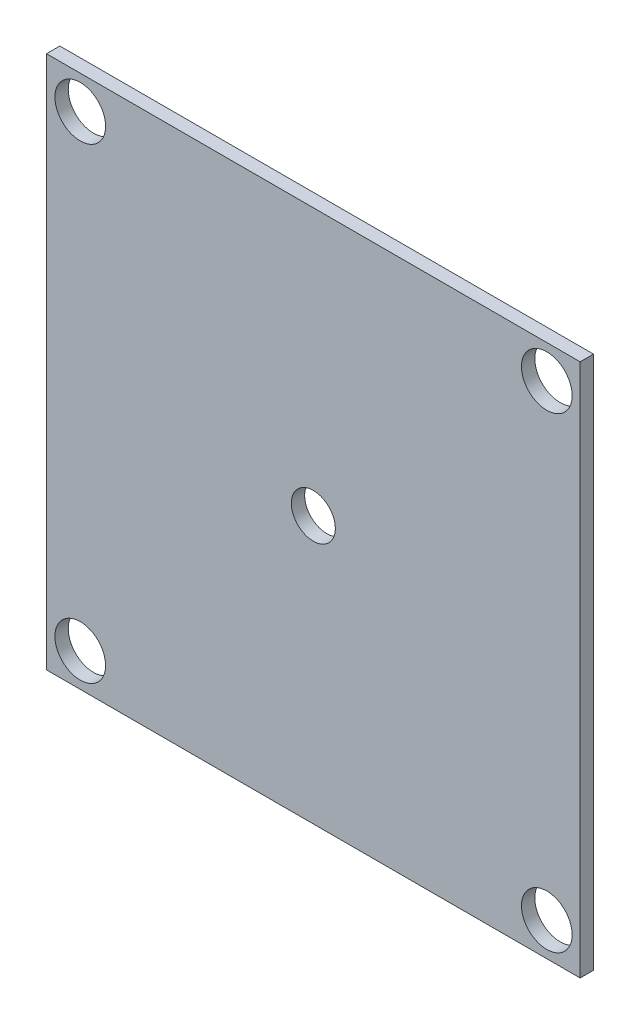
ISO-10303-21;
HEADER;
FILE_DESCRIPTION(('STEP AP214'),'2;1');
FILE_NAME('part.step','',(''),(''),'','','');
FILE_SCHEMA(('AUTOMOTIVE_DESIGN { 1 0 10303 214 1 1 1 1 }'));
ENDSEC;
DATA;
#1=APPLICATION_CONTEXT('core data for automotive mechanical design processes');
#2=APPLICATION_PROTOCOL_DEFINITION('international standard','automotive_design',2000,#1);
#3=PRODUCT_CONTEXT('',#1,'mechanical');
#4=PRODUCT('Part','Part','',(#3));
#5=PRODUCT_RELATED_PRODUCT_CATEGORY('part','',(#4));
#6=PRODUCT_DEFINITION_FORMATION('','',#4);
#7=PRODUCT_DEFINITION_CONTEXT('part definition',#1,'design');
#8=PRODUCT_DEFINITION('design','',#6,#7);
#9=PRODUCT_DEFINITION_SHAPE('','',#8);
#10=(LENGTH_UNIT() NAMED_UNIT(*) SI_UNIT(.MILLI.,.METRE.));
#11=(NAMED_UNIT(*) PLANE_ANGLE_UNIT() SI_UNIT($,.RADIAN.));
#12=(NAMED_UNIT(*) SI_UNIT($,.STERADIAN.) SOLID_ANGLE_UNIT());
#13=UNCERTAINTY_MEASURE_WITH_UNIT(LENGTH_MEASURE(1.E-05),#10,'distance_accuracy_value','');
#14=(GEOMETRIC_REPRESENTATION_CONTEXT(3) GLOBAL_UNCERTAINTY_ASSIGNED_CONTEXT((#13)) GLOBAL_UNIT_ASSIGNED_CONTEXT((#10,
#11,#12)) REPRESENTATION_CONTEXT('',''));
#15=CARTESIAN_POINT('',(0.,0.,0.));
#16=DIRECTION('',(0.,0.,1.));
#17=DIRECTION('',(1.,0.,0.));
#18=AXIS2_PLACEMENT_3D('',#15,#16,#17);
#19=CARTESIAN_POINT('',(50.8,-50.8,2.54));
#20=DIRECTION('',(-1.,0.,0.));
#21=DIRECTION('',(0.,0.,1.));
#22=AXIS2_PLACEMENT_3D('',#19,#20,#21);
#23=PLANE('',#22);
#24=DIRECTION('',(0.,1.,0.));
#25=VECTOR('',#24,1.);
#26=CARTESIAN_POINT('',(50.8,-50.8,0.));
#27=LINE('',#26,#25);
#28=CARTESIAN_POINT('',(50.8,-50.8,0.));
#29=VERTEX_POINT('',#28);
#30=CARTESIAN_POINT('',(50.8,50.8,0.));
#31=VERTEX_POINT('',#30);
#32=EDGE_CURVE('E104',#29,#31,#27,.T.);
#33=ORIENTED_EDGE('',*,*,#32,.T.);
#34=DIRECTION('',(0.,0.,-1.));
#35=VECTOR('',#34,1.);
#36=CARTESIAN_POINT('',(50.8,50.8,2.54));
#37=LINE('',#36,#35);
#38=CARTESIAN_POINT('',(50.8,50.8,2.54));
#39=VERTEX_POINT('',#38);
#40=EDGE_CURVE('E11',#39,#31,#37,.T.);
#41=ORIENTED_EDGE('',*,*,#40,.F.);
#42=DIRECTION('',(0.,1.,0.));
#43=VECTOR('',#42,1.);
#44=CARTESIAN_POINT('',(50.8,-50.8,2.54));
#45=LINE('',#44,#43);
#46=CARTESIAN_POINT('',(50.8,-50.8,2.54));
#47=VERTEX_POINT('',#46);
#48=EDGE_CURVE('E91',#47,#39,#45,.T.);
#49=ORIENTED_EDGE('',*,*,#48,.F.);
#50=DIRECTION('',(0.,0.,-1.));
#51=VECTOR('',#50,1.);
#52=CARTESIAN_POINT('',(50.8,-50.8,2.54));
#53=LINE('',#52,#51);
#54=EDGE_CURVE('E100',#47,#29,#53,.T.);
#55=ORIENTED_EDGE('',*,*,#54,.T.);
#56=EDGE_LOOP('',(#33,#41,#49,#55));
#57=FACE_BOUND('',#56,.T.);
#58=ADVANCED_FACE('F39',(#57),#23,.F.);
#59=CARTESIAN_POINT('',(-50.8,50.8,2.54));
#60=DIRECTION('',(0.,-1.,0.));
#61=DIRECTION('',(0.,0.,-1.));
#62=AXIS2_PLACEMENT_3D('',#59,#60,#61);
#63=PLANE('',#62);
#64=DIRECTION('',(-1.,0.,0.));
#65=VECTOR('',#64,1.);
#66=CARTESIAN_POINT('',(-50.8,50.8,0.));
#67=LINE('',#66,#65);
#68=CARTESIAN_POINT('',(-50.8,50.8,0.));
#69=VERTEX_POINT('',#68);
#70=EDGE_CURVE('E95',#31,#69,#67,.T.);
#71=ORIENTED_EDGE('',*,*,#70,.T.);
#72=DIRECTION('',(0.,0.,-1.));
#73=VECTOR('',#72,1.);
#74=CARTESIAN_POINT('',(-50.8,50.8,2.54));
#75=LINE('',#74,#73);
#76=CARTESIAN_POINT('',(-50.8,50.8,2.54));
#77=VERTEX_POINT('',#76);
#78=EDGE_CURVE('E48',#77,#69,#75,.T.);
#79=ORIENTED_EDGE('',*,*,#78,.F.);
#80=DIRECTION('',(-1.,0.,0.));
#81=VECTOR('',#80,1.);
#82=CARTESIAN_POINT('',(-50.8,50.8,2.54));
#83=LINE('',#82,#81);
#84=EDGE_CURVE('E86',#39,#77,#83,.T.);
#85=ORIENTED_EDGE('',*,*,#84,.F.);
#86=ORIENTED_EDGE('',*,*,#40,.T.);
#87=EDGE_LOOP('',(#71,#79,#85,#86));
#88=FACE_BOUND('',#87,.T.);
#89=ADVANCED_FACE('F94',(#88),#63,.F.);
#90=CARTESIAN_POINT('',(-50.8,-50.8,2.54));
#91=DIRECTION('',(1.,0.,0.));
#92=DIRECTION('',(0.,0.,-1.));
#93=AXIS2_PLACEMENT_3D('',#90,#91,#92);
#94=PLANE('',#93);
#95=DIRECTION('',(0.,-1.,0.));
#96=VECTOR('',#95,1.);
#97=CARTESIAN_POINT('',(-50.8,-50.8,0.));
#98=LINE('',#97,#96);
#99=CARTESIAN_POINT('',(-50.8,-50.8,0.));
#100=VERTEX_POINT('',#99);
#101=EDGE_CURVE('E73',#69,#100,#98,.T.);
#102=ORIENTED_EDGE('',*,*,#101,.T.);
#103=DIRECTION('',(0.,0.,-1.));
#104=VECTOR('',#103,1.);
#105=CARTESIAN_POINT('',(-50.8,-50.8,2.54));
#106=LINE('',#105,#104);
#107=CARTESIAN_POINT('',(-50.8,-50.8,2.54));
#108=VERTEX_POINT('',#107);
#109=EDGE_CURVE('E96',#108,#100,#106,.T.);
#110=ORIENTED_EDGE('',*,*,#109,.F.);
#111=DIRECTION('',(0.,-1.,0.));
#112=VECTOR('',#111,1.);
#113=CARTESIAN_POINT('',(-50.8,-50.8,2.54));
#114=LINE('',#113,#112);
#115=EDGE_CURVE('E89',#77,#108,#114,.T.);
#116=ORIENTED_EDGE('',*,*,#115,.F.);
#117=ORIENTED_EDGE('',*,*,#78,.T.);
#118=EDGE_LOOP('',(#102,#110,#116,#117));
#119=FACE_BOUND('',#118,.T.);
#120=ADVANCED_FACE('F98',(#119),#94,.F.);
#121=CARTESIAN_POINT('',(-50.8,-50.8,2.54));
#122=DIRECTION('',(0.,1.,0.));
#123=DIRECTION('',(0.,0.,1.));
#124=AXIS2_PLACEMENT_3D('',#121,#122,#123);
#125=PLANE('',#124);
#126=DIRECTION('',(1.,0.,0.));
#127=VECTOR('',#126,1.);
#128=CARTESIAN_POINT('',(-50.8,-50.8,0.));
#129=LINE('',#128,#127);
#130=EDGE_CURVE('E79',#100,#29,#129,.T.);
#131=ORIENTED_EDGE('',*,*,#130,.T.);
#132=ORIENTED_EDGE('',*,*,#54,.F.);
#133=DIRECTION('',(1.,0.,0.));
#134=VECTOR('',#133,1.);
#135=CARTESIAN_POINT('',(-50.8,-50.8,2.54));
#136=LINE('',#135,#134);
#137=EDGE_CURVE('E56',#108,#47,#136,.T.);
#138=ORIENTED_EDGE('',*,*,#137,.F.);
#139=ORIENTED_EDGE('',*,*,#109,.T.);
#140=EDGE_LOOP('',(#131,#132,#138,#139));
#141=FACE_BOUND('',#140,.T.);
#142=ADVANCED_FACE('F111',(#141),#125,.F.);
#143=CARTESIAN_POINT('',(0.,0.,2.54));
#144=DIRECTION('',(0.,0.,-1.));
#145=DIRECTION('',(-1.,0.,0.));
#146=AXIS2_PLACEMENT_3D('',#143,#144,#145);
#147=PLANE('',#146);
#148=CARTESIAN_POINT('',(-44.3772909723315,44.45,2.54));
#149=DIRECTION('',(0.,0.,-1.));
#150=DIRECTION('',(-1.,0.,0.));
#151=AXIS2_PLACEMENT_3D('',#148,#149,#150);
#152=CIRCLE('',#151,4.826);
#153=CARTESIAN_POINT('',(-49.2032909723314,44.45,2.54));
#154=VERTEX_POINT('',#153);
#155=EDGE_CURVE('E139',#154,#154,#152,.T.);
#156=ORIENTED_EDGE('',*,*,#155,.T.);
#157=EDGE_LOOP('',(#156));
#158=FACE_BOUND('',#157,.T.);
#159=CARTESIAN_POINT('',(44.45,44.45,2.54));
#160=DIRECTION('',(0.,0.,-1.));
#161=DIRECTION('',(-1.,0.,0.));
#162=AXIS2_PLACEMENT_3D('',#159,#160,#161);
#163=CIRCLE('',#162,4.826);
#164=CARTESIAN_POINT('',(39.624,44.45,2.54));
#165=VERTEX_POINT('',#164);
#166=EDGE_CURVE('E133',#165,#165,#163,.T.);
#167=ORIENTED_EDGE('',*,*,#166,.T.);
#168=EDGE_LOOP('',(#167));
#169=FACE_BOUND('',#168,.T.);
#170=CARTESIAN_POINT('',(44.45,-44.45,2.54));
#171=DIRECTION('',(0.,0.,-1.));
#172=DIRECTION('',(-1.,0.,0.));
#173=AXIS2_PLACEMENT_3D('',#170,#171,#172);
#174=CIRCLE('',#173,4.826);
#175=CARTESIAN_POINT('',(39.624,-44.45,2.54));
#176=VERTEX_POINT('',#175);
#177=EDGE_CURVE('E127',#176,#176,#174,.T.);
#178=ORIENTED_EDGE('',*,*,#177,.T.);
#179=EDGE_LOOP('',(#178));
#180=FACE_BOUND('',#179,.T.);
#181=CARTESIAN_POINT('',(-44.3772909723315,-44.45,2.54));
#182=DIRECTION('',(0.,0.,-1.));
#183=DIRECTION('',(-1.,0.,0.));
#184=AXIS2_PLACEMENT_3D('',#181,#182,#183);
#185=CIRCLE('',#184,4.826);
#186=CARTESIAN_POINT('',(-49.2032909723314,-44.45,2.54));
#187=VERTEX_POINT('',#186);
#188=EDGE_CURVE('E120',#187,#187,#185,.T.);
#189=ORIENTED_EDGE('',*,*,#188,.T.);
#190=EDGE_LOOP('',(#189));
#191=FACE_BOUND('',#190,.T.);
#192=CARTESIAN_POINT('',(0.,0.,2.54));
#193=DIRECTION('',(0.,0.,1.));
#194=DIRECTION('',(1.,0.,0.));
#195=AXIS2_PLACEMENT_3D('',#192,#193,#194);
#196=CIRCLE('',#195,4.191);
#197=CARTESIAN_POINT('',(4.191,0.,2.54));
#198=VERTEX_POINT('',#197);
#199=EDGE_CURVE('E117',#198,#198,#196,.T.);
#200=ORIENTED_EDGE('',*,*,#199,.F.);
#201=EDGE_LOOP('',(#200));
#202=FACE_BOUND('',#201,.T.);
#203=ORIENTED_EDGE('',*,*,#48,.T.);
#204=ORIENTED_EDGE('',*,*,#84,.T.);
#205=ORIENTED_EDGE('',*,*,#115,.T.);
#206=ORIENTED_EDGE('',*,*,#137,.T.);
#207=EDGE_LOOP('',(#203,#204,#205,#206));
#208=FACE_BOUND('',#207,.T.);
#209=ADVANCED_FACE('F87',(#158,#169,#180,#191,#202,#208),#147,.F.);
#210=CARTESIAN_POINT('',(0.,0.,0.));
#211=DIRECTION('',(0.,0.,-1.));
#212=DIRECTION('',(-1.,0.,0.));
#213=AXIS2_PLACEMENT_3D('',#210,#211,#212);
#214=PLANE('',#213);
#215=CARTESIAN_POINT('',(-44.3772909723315,44.45,0.));
#216=DIRECTION('',(0.,0.,-1.));
#217=DIRECTION('',(-1.,0.,0.));
#218=AXIS2_PLACEMENT_3D('',#215,#216,#217);
#219=CIRCLE('',#218,4.826);
#220=CARTESIAN_POINT('',(-49.2032909723314,44.45,0.));
#221=VERTEX_POINT('',#220);
#222=EDGE_CURVE('E124',#221,#221,#219,.T.);
#223=ORIENTED_EDGE('',*,*,#222,.F.);
#224=EDGE_LOOP('',(#223));
#225=FACE_BOUND('',#224,.T.);
#226=CARTESIAN_POINT('',(44.45,44.45,0.));
#227=DIRECTION('',(0.,0.,-1.));
#228=DIRECTION('',(-1.,0.,0.));
#229=AXIS2_PLACEMENT_3D('',#226,#227,#228);
#230=CIRCLE('',#229,4.826);
#231=CARTESIAN_POINT('',(39.624,44.45,0.));
#232=VERTEX_POINT('',#231);
#233=EDGE_CURVE('E136',#232,#232,#230,.T.);
#234=ORIENTED_EDGE('',*,*,#233,.F.);
#235=EDGE_LOOP('',(#234));
#236=FACE_BOUND('',#235,.T.);
#237=CARTESIAN_POINT('',(44.45,-44.45,0.));
#238=DIRECTION('',(0.,0.,-1.));
#239=DIRECTION('',(-1.,0.,0.));
#240=AXIS2_PLACEMENT_3D('',#237,#238,#239);
#241=CIRCLE('',#240,4.826);
#242=CARTESIAN_POINT('',(39.624,-44.45,0.));
#243=VERTEX_POINT('',#242);
#244=EDGE_CURVE('E130',#243,#243,#241,.T.);
#245=ORIENTED_EDGE('',*,*,#244,.F.);
#246=EDGE_LOOP('',(#245));
#247=FACE_BOUND('',#246,.T.);
#248=CARTESIAN_POINT('',(-44.3772909723315,-44.45,0.));
#249=DIRECTION('',(0.,0.,-1.));
#250=DIRECTION('',(-1.,0.,0.));
#251=AXIS2_PLACEMENT_3D('',#248,#249,#250);
#252=CIRCLE('',#251,4.826);
#253=CARTESIAN_POINT('',(-49.2032909723314,-44.45,0.));
#254=VERTEX_POINT('',#253);
#255=EDGE_CURVE('E121',#254,#254,#252,.T.);
#256=ORIENTED_EDGE('',*,*,#255,.F.);
#257=EDGE_LOOP('',(#256));
#258=FACE_BOUND('',#257,.T.);
#259=CARTESIAN_POINT('',(0.,0.,0.));
#260=DIRECTION('',(0.,0.,-1.));
#261=DIRECTION('',(-1.,0.,0.));
#262=AXIS2_PLACEMENT_3D('',#259,#260,#261);
#263=CIRCLE('',#262,4.191);
#264=CARTESIAN_POINT('',(-4.191,0.,0.));
#265=VERTEX_POINT('',#264);
#266=EDGE_CURVE('E42',#265,#265,#263,.T.);
#267=ORIENTED_EDGE('',*,*,#266,.F.);
#268=EDGE_LOOP('',(#267));
#269=FACE_BOUND('',#268,.T.);
#270=ORIENTED_EDGE('',*,*,#32,.F.);
#271=ORIENTED_EDGE('',*,*,#130,.F.);
#272=ORIENTED_EDGE('',*,*,#101,.F.);
#273=ORIENTED_EDGE('',*,*,#70,.F.);
#274=EDGE_LOOP('',(#270,#271,#272,#273));
#275=FACE_BOUND('',#274,.T.);
#276=ADVANCED_FACE('F114',(#225,#236,#247,#258,#269,#275),#214,.T.);
#277=CARTESIAN_POINT('',(0.,0.,-632.46));
#278=DIRECTION('',(0.,0.,1.));
#279=DIRECTION('',(1.,0.,0.));
#280=AXIS2_PLACEMENT_3D('',#277,#278,#279);
#281=CYLINDRICAL_SURFACE('',#280,4.191);
#282=ORIENTED_EDGE('',*,*,#266,.T.);
#283=EDGE_LOOP('',(#282));
#284=FACE_BOUND('',#283,.T.);
#285=ORIENTED_EDGE('',*,*,#199,.T.);
#286=EDGE_LOOP('',(#285));
#287=FACE_BOUND('',#286,.T.);
#288=ADVANCED_FACE('F149',(#284,#287),#281,.F.);
#289=CARTESIAN_POINT('',(-44.3772909723315,-44.45,2.54));
#290=DIRECTION('',(0.,0.,-1.));
#291=DIRECTION('',(-1.,0.,0.));
#292=AXIS2_PLACEMENT_3D('',#289,#290,#291);
#293=CYLINDRICAL_SURFACE('',#292,4.826);
#294=ORIENTED_EDGE('',*,*,#188,.F.);
#295=EDGE_LOOP('',(#294));
#296=FACE_BOUND('',#295,.T.);
#297=ORIENTED_EDGE('',*,*,#255,.T.);
#298=EDGE_LOOP('',(#297));
#299=FACE_BOUND('',#298,.T.);
#300=ADVANCED_FACE('F162',(#296,#299),#293,.F.);
#301=CARTESIAN_POINT('',(44.45,-44.45,2.54));
#302=DIRECTION('',(0.,0.,-1.));
#303=DIRECTION('',(-1.,0.,0.));
#304=AXIS2_PLACEMENT_3D('',#301,#302,#303);
#305=CYLINDRICAL_SURFACE('',#304,4.826);
#306=ORIENTED_EDGE('',*,*,#177,.F.);
#307=EDGE_LOOP('',(#306));
#308=FACE_BOUND('',#307,.T.);
#309=ORIENTED_EDGE('',*,*,#244,.T.);
#310=EDGE_LOOP('',(#309));
#311=FACE_BOUND('',#310,.T.);
#312=ADVANCED_FACE('F213',(#308,#311),#305,.F.);
#313=CARTESIAN_POINT('',(44.45,44.45,2.54));
#314=DIRECTION('',(0.,0.,-1.));
#315=DIRECTION('',(-1.,0.,0.));
#316=AXIS2_PLACEMENT_3D('',#313,#314,#315);
#317=CYLINDRICAL_SURFACE('',#316,4.826);
#318=ORIENTED_EDGE('',*,*,#166,.F.);
#319=EDGE_LOOP('',(#318));
#320=FACE_BOUND('',#319,.T.);
#321=ORIENTED_EDGE('',*,*,#233,.T.);
#322=EDGE_LOOP('',(#321));
#323=FACE_BOUND('',#322,.T.);
#324=ADVANCED_FACE('F223',(#320,#323),#317,.F.);
#325=CARTESIAN_POINT('',(-44.3772909723315,44.45,2.54));
#326=DIRECTION('',(0.,0.,-1.));
#327=DIRECTION('',(-1.,0.,0.));
#328=AXIS2_PLACEMENT_3D('',#325,#326,#327);
#329=CYLINDRICAL_SURFACE('',#328,4.826);
#330=ORIENTED_EDGE('',*,*,#155,.F.);
#331=EDGE_LOOP('',(#330));
#332=FACE_BOUND('',#331,.T.);
#333=ORIENTED_EDGE('',*,*,#222,.T.);
#334=EDGE_LOOP('',(#333));
#335=FACE_BOUND('',#334,.T.);
#336=ADVANCED_FACE('F145',(#332,#335),#329,.F.);
#337=CLOSED_SHELL('',(#58,#89,#120,#142,#209,#276,#288,#300,#312,#324,#336));
#338=MANIFOLD_SOLID_BREP('B2',#337);
#339=ADVANCED_BREP_SHAPE_REPRESENTATION('',(#18,#338),#14);
#340=SHAPE_DEFINITION_REPRESENTATION(#9,#339);
ENDSEC;
END-ISO-10303-21;
